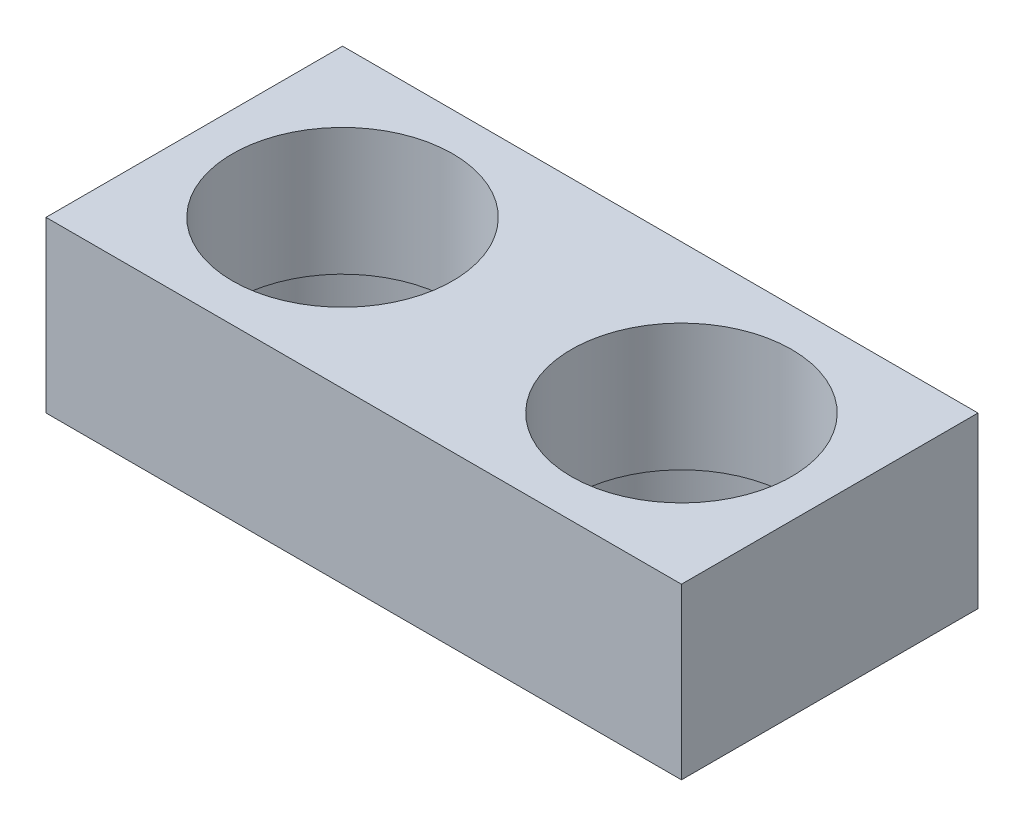
ISO-10303-21;
HEADER;
FILE_DESCRIPTION(('STEP AP214'),'2;1');
FILE_NAME('part.step','',(''),(''),'','','');
FILE_SCHEMA(('AUTOMOTIVE_DESIGN { 1 0 10303 214 1 1 1 1 }'));
ENDSEC;
DATA;
#1=APPLICATION_CONTEXT('core data for automotive mechanical design processes');
#2=APPLICATION_PROTOCOL_DEFINITION('international standard','automotive_design',2000,#1);
#3=PRODUCT_CONTEXT('',#1,'mechanical');
#4=PRODUCT('Part','Part','',(#3));
#5=PRODUCT_RELATED_PRODUCT_CATEGORY('part','',(#4));
#6=PRODUCT_DEFINITION_FORMATION('','',#4);
#7=PRODUCT_DEFINITION_CONTEXT('part definition',#1,'design');
#8=PRODUCT_DEFINITION('design','',#6,#7);
#9=PRODUCT_DEFINITION_SHAPE('','',#8);
#10=(LENGTH_UNIT() NAMED_UNIT(*) SI_UNIT(.MILLI.,.METRE.));
#11=(NAMED_UNIT(*) PLANE_ANGLE_UNIT() SI_UNIT($,.RADIAN.));
#12=(NAMED_UNIT(*) SI_UNIT($,.STERADIAN.) SOLID_ANGLE_UNIT());
#13=UNCERTAINTY_MEASURE_WITH_UNIT(LENGTH_MEASURE(1.E-05),#10,'distance_accuracy_value','');
#14=(GEOMETRIC_REPRESENTATION_CONTEXT(3) GLOBAL_UNCERTAINTY_ASSIGNED_CONTEXT((#13)) GLOBAL_UNIT_ASSIGNED_CONTEXT((#10,
#11,#12)) REPRESENTATION_CONTEXT('',''));
#15=CARTESIAN_POINT('',(0.,0.,0.));
#16=DIRECTION('',(0.,0.,1.));
#17=DIRECTION('',(1.,0.,0.));
#18=AXIS2_PLACEMENT_3D('',#15,#16,#17);
#19=CARTESIAN_POINT('',(-8.,4.,0.));
#20=DIRECTION('',(0.,-1.,0.));
#21=DIRECTION('',(0.,0.,-1.));
#22=AXIS2_PLACEMENT_3D('',#19,#20,#21);
#23=CYLINDRICAL_SURFACE('',#22,2.6);
#24=CARTESIAN_POINT('',(-8.,4.,0.));
#25=DIRECTION('',(0.,1.,0.));
#26=DIRECTION('',(0.,0.,1.));
#27=AXIS2_PLACEMENT_3D('',#24,#25,#26);
#28=CIRCLE('',#27,2.6);
#29=CARTESIAN_POINT('',(-8.,4.,2.6));
#30=VERTEX_POINT('',#29);
#31=EDGE_CURVE('E149',#30,#30,#28,.T.);
#32=ORIENTED_EDGE('',*,*,#31,.T.);
#33=EDGE_LOOP('',(#32));
#34=FACE_BOUND('',#33,.T.);
#35=CARTESIAN_POINT('',(-8.,1.,0.));
#36=DIRECTION('',(0.,-1.,0.));
#37=DIRECTION('',(0.,0.,-1.));
#38=AXIS2_PLACEMENT_3D('',#35,#36,#37);
#39=CIRCLE('',#38,2.6);
#40=CARTESIAN_POINT('',(-8.,1.,-2.6));
#41=VERTEX_POINT('',#40);
#42=EDGE_CURVE('E73',#41,#41,#39,.T.);
#43=ORIENTED_EDGE('',*,*,#42,.T.);
#44=EDGE_LOOP('',(#43));
#45=FACE_BOUND('',#44,.T.);
#46=ADVANCED_FACE('F69',(#34,#45),#23,.F.);
#47=CARTESIAN_POINT('',(0.,4.,0.));
#48=DIRECTION('',(0.,-1.,0.));
#49=DIRECTION('',(0.,0.,-1.));
#50=AXIS2_PLACEMENT_3D('',#47,#48,#49);
#51=CYLINDRICAL_SURFACE('',#50,2.6);
#52=CARTESIAN_POINT('',(0.,4.,0.));
#53=DIRECTION('',(0.,1.,0.));
#54=DIRECTION('',(0.,0.,1.));
#55=AXIS2_PLACEMENT_3D('',#52,#53,#54);
#56=CIRCLE('',#55,2.6);
#57=CARTESIAN_POINT('',(0.,4.,2.6));
#58=VERTEX_POINT('',#57);
#59=EDGE_CURVE('E169',#58,#58,#56,.T.);
#60=ORIENTED_EDGE('',*,*,#59,.T.);
#61=EDGE_LOOP('',(#60));
#62=FACE_BOUND('',#61,.T.);
#63=CARTESIAN_POINT('',(0.,1.,0.));
#64=DIRECTION('',(0.,-1.,0.));
#65=DIRECTION('',(0.,0.,-1.));
#66=AXIS2_PLACEMENT_3D('',#63,#64,#65);
#67=CIRCLE('',#66,2.6);
#68=CARTESIAN_POINT('',(0.,1.,-2.6));
#69=VERTEX_POINT('',#68);
#70=EDGE_CURVE('E160',#69,#69,#67,.T.);
#71=ORIENTED_EDGE('',*,*,#70,.T.);
#72=EDGE_LOOP('',(#71));
#73=FACE_BOUND('',#72,.T.);
#74=ADVANCED_FACE('F197',(#62,#73),#51,.F.);
#75=CARTESIAN_POINT('',(0.,4.,0.));
#76=DIRECTION('',(0.,1.,0.));
#77=DIRECTION('',(0.,0.,1.));
#78=AXIS2_PLACEMENT_3D('',#75,#76,#77);
#79=PLANE('',#78);
#80=ORIENTED_EDGE('',*,*,#31,.F.);
#81=EDGE_LOOP('',(#80));
#82=FACE_BOUND('',#81,.T.);
#83=DIRECTION('',(1.,0.,0.));
#84=VECTOR('',#83,1.);
#85=CARTESIAN_POINT('',(-11.5,4.,-3.5));
#86=LINE('',#85,#84);
#87=CARTESIAN_POINT('',(-11.5,4.,-3.5));
#88=VERTEX_POINT('',#87);
#89=CARTESIAN_POINT('',(3.5,4.,-3.5));
#90=VERTEX_POINT('',#89);
#91=EDGE_CURVE('E135',#88,#90,#86,.T.);
#92=ORIENTED_EDGE('',*,*,#91,.F.);
#93=DIRECTION('',(0.,0.,-1.));
#94=VECTOR('',#93,1.);
#95=CARTESIAN_POINT('',(-11.5,4.,3.5));
#96=LINE('',#95,#94);
#97=CARTESIAN_POINT('',(-11.5,4.,3.5));
#98=VERTEX_POINT('',#97);
#99=EDGE_CURVE('E120',#98,#88,#96,.T.);
#100=ORIENTED_EDGE('',*,*,#99,.F.);
#101=DIRECTION('',(1.,0.,0.));
#102=VECTOR('',#101,1.);
#103=CARTESIAN_POINT('',(-11.5,4.,3.5));
#104=LINE('',#103,#102);
#105=CARTESIAN_POINT('',(3.5,4.,3.5));
#106=VERTEX_POINT('',#105);
#107=EDGE_CURVE('E116',#98,#106,#104,.T.);
#108=ORIENTED_EDGE('',*,*,#107,.T.);
#109=DIRECTION('',(0.,0.,-1.));
#110=VECTOR('',#109,1.);
#111=CARTESIAN_POINT('',(3.5,4.,3.5));
#112=LINE('',#111,#110);
#113=EDGE_CURVE('E113',#106,#90,#112,.T.);
#114=ORIENTED_EDGE('',*,*,#113,.T.);
#115=EDGE_LOOP('',(#92,#100,#108,#114));
#116=FACE_BOUND('',#115,.T.);
#117=ORIENTED_EDGE('',*,*,#59,.F.);
#118=EDGE_LOOP('',(#117));
#119=FACE_BOUND('',#118,.T.);
#120=ADVANCED_FACE('F118',(#82,#116,#119),#79,.T.);
#121=CARTESIAN_POINT('',(0.,0.,0.));
#122=DIRECTION('',(0.,1.,0.));
#123=DIRECTION('',(0.,0.,1.));
#124=AXIS2_PLACEMENT_3D('',#121,#122,#123);
#125=PLANE('',#124);
#126=CARTESIAN_POINT('',(0.,0.,0.));
#127=DIRECTION('',(0.,-1.,0.));
#128=DIRECTION('',(0.,0.,-1.));
#129=AXIS2_PLACEMENT_3D('',#126,#127,#128);
#130=CIRCLE('',#129,3.);
#131=CARTESIAN_POINT('',(0.,0.,-3.));
#132=VERTEX_POINT('',#131);
#133=EDGE_CURVE('E171',#132,#132,#130,.T.);
#134=ORIENTED_EDGE('',*,*,#133,.F.);
#135=EDGE_LOOP('',(#134));
#136=FACE_BOUND('',#135,.T.);
#137=CARTESIAN_POINT('',(-8.,0.,0.));
#138=DIRECTION('',(0.,-1.,0.));
#139=DIRECTION('',(0.,0.,-1.));
#140=AXIS2_PLACEMENT_3D('',#137,#138,#139);
#141=CIRCLE('',#140,3.);
#142=CARTESIAN_POINT('',(-8.,0.,-3.));
#143=VERTEX_POINT('',#142);
#144=EDGE_CURVE('E183',#143,#143,#141,.T.);
#145=ORIENTED_EDGE('',*,*,#144,.F.);
#146=EDGE_LOOP('',(#145));
#147=FACE_BOUND('',#146,.T.);
#148=DIRECTION('',(1.,0.,0.));
#149=VECTOR('',#148,1.);
#150=CARTESIAN_POINT('',(-11.5,0.,-3.5));
#151=LINE('',#150,#149);
#152=CARTESIAN_POINT('',(-11.5,0.,-3.5));
#153=VERTEX_POINT('',#152);
#154=CARTESIAN_POINT('',(3.5,0.,-3.5));
#155=VERTEX_POINT('',#154);
#156=EDGE_CURVE('E144',#153,#155,#151,.T.);
#157=ORIENTED_EDGE('',*,*,#156,.T.);
#158=DIRECTION('',(0.,0.,-1.));
#159=VECTOR('',#158,1.);
#160=CARTESIAN_POINT('',(3.5,0.,3.5));
#161=LINE('',#160,#159);
#162=CARTESIAN_POINT('',(3.5,0.,3.5));
#163=VERTEX_POINT('',#162);
#164=EDGE_CURVE('E148',#163,#155,#161,.T.);
#165=ORIENTED_EDGE('',*,*,#164,.F.);
#166=DIRECTION('',(1.,0.,0.));
#167=VECTOR('',#166,1.);
#168=CARTESIAN_POINT('',(-11.5,0.,3.5));
#169=LINE('',#168,#167);
#170=CARTESIAN_POINT('',(-11.5,0.,3.5));
#171=VERTEX_POINT('',#170);
#172=EDGE_CURVE('E126',#171,#163,#169,.T.);
#173=ORIENTED_EDGE('',*,*,#172,.F.);
#174=DIRECTION('',(0.,0.,-1.));
#175=VECTOR('',#174,1.);
#176=CARTESIAN_POINT('',(-11.5,0.,3.5));
#177=LINE('',#176,#175);
#178=EDGE_CURVE('E138',#171,#153,#177,.T.);
#179=ORIENTED_EDGE('',*,*,#178,.T.);
#180=EDGE_LOOP('',(#157,#165,#173,#179));
#181=FACE_BOUND('',#180,.T.);
#182=ADVANCED_FACE('F196',(#136,#147,#181),#125,.F.);
#183=CARTESIAN_POINT('',(-11.5,4.,-3.5));
#184=DIRECTION('',(0.,0.,-1.));
#185=DIRECTION('',(-1.,0.,0.));
#186=AXIS2_PLACEMENT_3D('',#183,#184,#185);
#187=PLANE('',#186);
#188=ORIENTED_EDGE('',*,*,#156,.F.);
#189=DIRECTION('',(0.,-1.,0.));
#190=VECTOR('',#189,1.);
#191=CARTESIAN_POINT('',(-11.5,4.,-3.5));
#192=LINE('',#191,#190);
#193=EDGE_CURVE('E12',#88,#153,#192,.T.);
#194=ORIENTED_EDGE('',*,*,#193,.F.);
#195=ORIENTED_EDGE('',*,*,#91,.T.);
#196=DIRECTION('',(0.,-1.,0.));
#197=VECTOR('',#196,1.);
#198=CARTESIAN_POINT('',(3.5,4.,-3.5));
#199=LINE('',#198,#197);
#200=EDGE_CURVE('E131',#90,#155,#199,.T.);
#201=ORIENTED_EDGE('',*,*,#200,.T.);
#202=EDGE_LOOP('',(#188,#194,#195,#201));
#203=FACE_BOUND('',#202,.T.);
#204=ADVANCED_FACE('F71',(#203),#187,.T.);
#205=CARTESIAN_POINT('',(-11.5,4.,3.5));
#206=DIRECTION('',(-1.,0.,0.));
#207=DIRECTION('',(0.,0.,1.));
#208=AXIS2_PLACEMENT_3D('',#205,#206,#207);
#209=PLANE('',#208);
#210=ORIENTED_EDGE('',*,*,#178,.F.);
#211=DIRECTION('',(0.,-1.,0.));
#212=VECTOR('',#211,1.);
#213=CARTESIAN_POINT('',(-11.5,4.,3.5));
#214=LINE('',#213,#212);
#215=EDGE_CURVE('E80',#98,#171,#214,.T.);
#216=ORIENTED_EDGE('',*,*,#215,.F.);
#217=ORIENTED_EDGE('',*,*,#99,.T.);
#218=ORIENTED_EDGE('',*,*,#193,.T.);
#219=EDGE_LOOP('',(#210,#216,#217,#218));
#220=FACE_BOUND('',#219,.T.);
#221=ADVANCED_FACE('F273',(#220),#209,.T.);
#222=CARTESIAN_POINT('',(-11.5,4.,3.5));
#223=DIRECTION('',(0.,0.,-1.));
#224=DIRECTION('',(-1.,0.,0.));
#225=AXIS2_PLACEMENT_3D('',#222,#223,#224);
#226=PLANE('',#225);
#227=ORIENTED_EDGE('',*,*,#172,.T.);
#228=DIRECTION('',(0.,-1.,0.));
#229=VECTOR('',#228,1.);
#230=CARTESIAN_POINT('',(3.5,4.,3.5));
#231=LINE('',#230,#229);
#232=EDGE_CURVE('E124',#106,#163,#231,.T.);
#233=ORIENTED_EDGE('',*,*,#232,.F.);
#234=ORIENTED_EDGE('',*,*,#107,.F.);
#235=ORIENTED_EDGE('',*,*,#215,.T.);
#236=EDGE_LOOP('',(#227,#233,#234,#235));
#237=FACE_BOUND('',#236,.T.);
#238=ADVANCED_FACE('F125',(#237),#226,.F.);
#239=CARTESIAN_POINT('',(3.5,4.,3.5));
#240=DIRECTION('',(-1.,0.,0.));
#241=DIRECTION('',(0.,0.,1.));
#242=AXIS2_PLACEMENT_3D('',#239,#240,#241);
#243=PLANE('',#242);
#244=ORIENTED_EDGE('',*,*,#164,.T.);
#245=ORIENTED_EDGE('',*,*,#200,.F.);
#246=ORIENTED_EDGE('',*,*,#113,.F.);
#247=ORIENTED_EDGE('',*,*,#232,.T.);
#248=EDGE_LOOP('',(#244,#245,#246,#247));
#249=FACE_BOUND('',#248,.T.);
#250=ADVANCED_FACE('F133',(#249),#243,.F.);
#251=CARTESIAN_POINT('',(0.,1.,0.));
#252=DIRECTION('',(0.,-1.,0.));
#253=DIRECTION('',(0.,0.,-1.));
#254=AXIS2_PLACEMENT_3D('',#251,#252,#253);
#255=CYLINDRICAL_SURFACE('',#254,3.);
#256=CARTESIAN_POINT('',(0.,1.,0.));
#257=DIRECTION('',(0.,-1.,0.));
#258=DIRECTION('',(0.,0.,-1.));
#259=AXIS2_PLACEMENT_3D('',#256,#257,#258);
#260=CIRCLE('',#259,3.);
#261=CARTESIAN_POINT('',(0.,1.,-3.));
#262=VERTEX_POINT('',#261);
#263=EDGE_CURVE('E163',#262,#262,#260,.T.);
#264=ORIENTED_EDGE('',*,*,#263,.F.);
#265=EDGE_LOOP('',(#264));
#266=FACE_BOUND('',#265,.T.);
#267=ORIENTED_EDGE('',*,*,#133,.T.);
#268=EDGE_LOOP('',(#267));
#269=FACE_BOUND('',#268,.T.);
#270=ADVANCED_FACE('F221',(#266,#269),#255,.F.);
#271=CARTESIAN_POINT('',(0.,1.,0.));
#272=DIRECTION('',(0.,-1.,0.));
#273=DIRECTION('',(0.,0.,-1.));
#274=AXIS2_PLACEMENT_3D('',#271,#272,#273);
#275=PLANE('',#274);
#276=ORIENTED_EDGE('',*,*,#70,.F.);
#277=EDGE_LOOP('',(#276));
#278=FACE_BOUND('',#277,.T.);
#279=ORIENTED_EDGE('',*,*,#263,.T.);
#280=EDGE_LOOP('',(#279));
#281=FACE_BOUND('',#280,.T.);
#282=ADVANCED_FACE('F216',(#278,#281),#275,.T.);
#283=CARTESIAN_POINT('',(-8.,1.,0.));
#284=DIRECTION('',(0.,-1.,0.));
#285=DIRECTION('',(0.,0.,-1.));
#286=AXIS2_PLACEMENT_3D('',#283,#284,#285);
#287=CYLINDRICAL_SURFACE('',#286,3.);
#288=CARTESIAN_POINT('',(-8.,1.,0.));
#289=DIRECTION('',(0.,-1.,0.));
#290=DIRECTION('',(0.,0.,-1.));
#291=AXIS2_PLACEMENT_3D('',#288,#289,#290);
#292=CIRCLE('',#291,3.);
#293=CARTESIAN_POINT('',(-8.,1.,-3.));
#294=VERTEX_POINT('',#293);
#295=EDGE_CURVE('E177',#294,#294,#292,.T.);
#296=ORIENTED_EDGE('',*,*,#295,.F.);
#297=EDGE_LOOP('',(#296));
#298=FACE_BOUND('',#297,.T.);
#299=ORIENTED_EDGE('',*,*,#144,.T.);
#300=EDGE_LOOP('',(#299));
#301=FACE_BOUND('',#300,.T.);
#302=ADVANCED_FACE('F212',(#298,#301),#287,.F.);
#303=CARTESIAN_POINT('',(-8.,1.,0.));
#304=DIRECTION('',(0.,-1.,0.));
#305=DIRECTION('',(0.,0.,-1.));
#306=AXIS2_PLACEMENT_3D('',#303,#304,#305);
#307=PLANE('',#306);
#308=ORIENTED_EDGE('',*,*,#42,.F.);
#309=EDGE_LOOP('',(#308));
#310=FACE_BOUND('',#309,.T.);
#311=ORIENTED_EDGE('',*,*,#295,.T.);
#312=EDGE_LOOP('',(#311));
#313=FACE_BOUND('',#312,.T.);
#314=ADVANCED_FACE('F215',(#310,#313),#307,.T.);
#315=CLOSED_SHELL('',(#46,#74,#120,#182,#204,#221,#238,#250,#270,#282,#302,#314));
#316=MANIFOLD_SOLID_BREP('B2',#315);
#317=ADVANCED_BREP_SHAPE_REPRESENTATION('',(#18,#316),#14);
#318=SHAPE_DEFINITION_REPRESENTATION(#9,#317);
ENDSEC;
END-ISO-10303-21;
